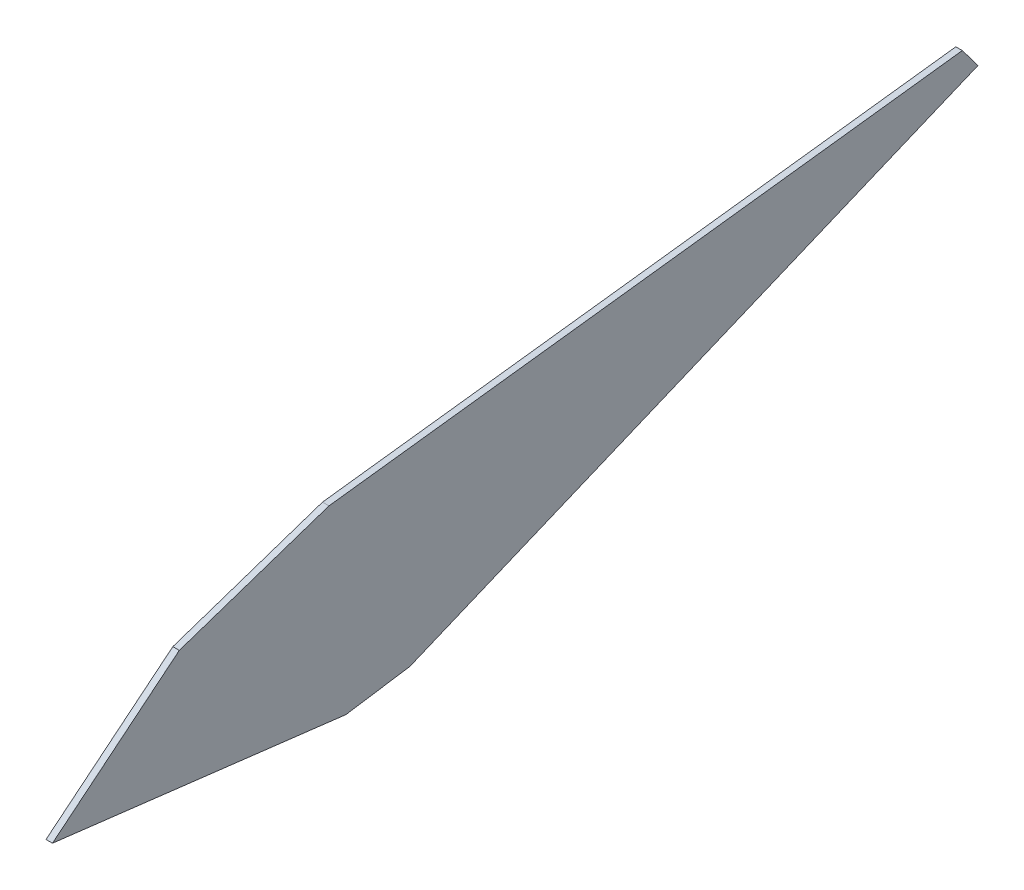
ISO-10303-21;
HEADER;
FILE_DESCRIPTION(('STEP AP214'),'2;1');
FILE_NAME('part.step','',(''),(''),'','','');
FILE_SCHEMA(('AUTOMOTIVE_DESIGN { 1 0 10303 214 1 1 1 1 }'));
ENDSEC;
DATA;
#1=APPLICATION_CONTEXT('core data for automotive mechanical design processes');
#2=APPLICATION_PROTOCOL_DEFINITION('international standard','automotive_design',2000,#1);
#3=PRODUCT_CONTEXT('',#1,'mechanical');
#4=PRODUCT('Part','Part','',(#3));
#5=PRODUCT_RELATED_PRODUCT_CATEGORY('part','',(#4));
#6=PRODUCT_DEFINITION_FORMATION('','',#4);
#7=PRODUCT_DEFINITION_CONTEXT('part definition',#1,'design');
#8=PRODUCT_DEFINITION('design','',#6,#7);
#9=PRODUCT_DEFINITION_SHAPE('','',#8);
#10=(LENGTH_UNIT() NAMED_UNIT(*) SI_UNIT(.MILLI.,.METRE.));
#11=(NAMED_UNIT(*) PLANE_ANGLE_UNIT() SI_UNIT($,.RADIAN.));
#12=(NAMED_UNIT(*) SI_UNIT($,.STERADIAN.) SOLID_ANGLE_UNIT());
#13=UNCERTAINTY_MEASURE_WITH_UNIT(LENGTH_MEASURE(1.E-05),#10,'distance_accuracy_value','');
#14=(GEOMETRIC_REPRESENTATION_CONTEXT(3) GLOBAL_UNCERTAINTY_ASSIGNED_CONTEXT((#13)) GLOBAL_UNIT_ASSIGNED_CONTEXT((#10,
#11,#12)) REPRESENTATION_CONTEXT('',''));
#15=CARTESIAN_POINT('',(0.,0.,0.));
#16=DIRECTION('',(0.,0.,1.));
#17=DIRECTION('',(1.,0.,0.));
#18=AXIS2_PLACEMENT_3D('',#15,#16,#17);
#19=CARTESIAN_POINT('',(0.635,-17.46504,30.30982));
#20=DIRECTION('',(0.,0.923267357697167,0.384158022447652));
#21=DIRECTION('',(0.,-0.384158022447652,0.923267357697168));
#22=AXIS2_PLACEMENT_3D('',#19,#20,#21);
#23=PLANE('',#22);
#24=DIRECTION('',(0.,0.384158022447652,-0.923267357697168));
#25=VECTOR('',#24,1.);
#26=CARTESIAN_POINT('',(0.,-17.46504,30.30982));
#27=LINE('',#26,#25);
#28=CARTESIAN_POINT('',(0.,-17.46504,30.30982));
#29=VERTEX_POINT('',#28);
#30=CARTESIAN_POINT('',(0.,5.715,-25.4));
#31=VERTEX_POINT('',#30);
#32=EDGE_CURVE('E124',#29,#31,#27,.T.);
#33=ORIENTED_EDGE('',*,*,#32,.T.);
#34=DIRECTION('',(-1.,0.,0.));
#35=VECTOR('',#34,1.);
#36=CARTESIAN_POINT('',(0.635,5.715,-25.4));
#37=LINE('',#36,#35);
#38=CARTESIAN_POINT('',(0.635,5.715,-25.4));
#39=VERTEX_POINT('',#38);
#40=EDGE_CURVE('E11',#39,#31,#37,.T.);
#41=ORIENTED_EDGE('',*,*,#40,.F.);
#42=DIRECTION('',(0.,0.384158022447652,-0.923267357697168));
#43=VECTOR('',#42,1.);
#44=CARTESIAN_POINT('',(0.635,-17.46504,30.30982));
#45=LINE('',#44,#43);
#46=CARTESIAN_POINT('',(0.635,-17.46504,30.30982));
#47=VERTEX_POINT('',#46);
#48=EDGE_CURVE('E136',#47,#39,#45,.T.);
#49=ORIENTED_EDGE('',*,*,#48,.F.);
#50=DIRECTION('',(-1.,0.,0.));
#51=VECTOR('',#50,1.);
#52=CARTESIAN_POINT('',(0.635,-17.46504,30.30982));
#53=LINE('',#52,#51);
#54=EDGE_CURVE('E120',#47,#29,#53,.T.);
#55=ORIENTED_EDGE('',*,*,#54,.T.);
#56=EDGE_LOOP('',(#33,#41,#49,#55));
#57=FACE_BOUND('',#56,.T.);
#58=ADVANCED_FACE('F34',(#57),#23,.F.);
#59=CARTESIAN_POINT('',(0.635,5.715,-25.4));
#60=DIRECTION('',(0.,-0.601905322033391,0.798567456955191));
#61=DIRECTION('',(0.,-0.798567456955191,-0.601905322033391));
#62=AXIS2_PLACEMENT_3D('',#59,#60,#61);
#63=PLANE('',#62);
#64=DIRECTION('',(0.,0.798567456955191,0.601905322033391));
#65=VECTOR('',#64,1.);
#66=CARTESIAN_POINT('',(0.,5.715,-25.4));
#67=LINE('',#66,#65);
#68=CARTESIAN_POINT('',(0.,7.75716,-23.86076));
#69=VERTEX_POINT('',#68);
#70=EDGE_CURVE('E127',#31,#69,#67,.T.);
#71=ORIENTED_EDGE('',*,*,#70,.T.);
#72=DIRECTION('',(-1.,0.,0.));
#73=VECTOR('',#72,1.);
#74=CARTESIAN_POINT('',(0.635,7.75716,-23.86076));
#75=LINE('',#74,#73);
#76=CARTESIAN_POINT('',(0.635,7.75716,-23.86076));
#77=VERTEX_POINT('',#76);
#78=EDGE_CURVE('E42',#77,#69,#75,.T.);
#79=ORIENTED_EDGE('',*,*,#78,.F.);
#80=DIRECTION('',(0.,0.798567456955191,0.601905322033391));
#81=VECTOR('',#80,1.);
#82=CARTESIAN_POINT('',(0.635,5.715,-25.4));
#83=LINE('',#82,#81);
#84=EDGE_CURVE('E90',#39,#77,#83,.T.);
#85=ORIENTED_EDGE('',*,*,#84,.F.);
#86=ORIENTED_EDGE('',*,*,#40,.T.);
#87=EDGE_LOOP('',(#71,#79,#85,#86));
#88=FACE_BOUND('',#87,.T.);
#89=ADVANCED_FACE('F161',(#88),#63,.F.);
#90=CARTESIAN_POINT('',(0.635,7.75716,-23.86076));
#91=DIRECTION('',(0.,-0.992563085406152,-0.121731349655791));
#92=DIRECTION('',(0.,0.121731349655791,-0.992563085406152));
#93=AXIS2_PLACEMENT_3D('',#90,#91,#92);
#94=PLANE('',#93);
#95=DIRECTION('',(0.,-0.121731349655791,0.992563085406152));
#96=VECTOR('',#95,1.);
#97=CARTESIAN_POINT('',(0.,7.75716,-23.86076));
#98=LINE('',#97,#96);
#99=CARTESIAN_POINT('',(0.,0.1397,38.24986));
#100=VERTEX_POINT('',#99);
#101=EDGE_CURVE('E129',#69,#100,#98,.T.);
#102=ORIENTED_EDGE('',*,*,#101,.T.);
#103=DIRECTION('',(-1.,0.,0.));
#104=VECTOR('',#103,1.);
#105=CARTESIAN_POINT('',(0.635,0.1397,38.24986));
#106=LINE('',#105,#104);
#107=CARTESIAN_POINT('',(0.635,0.1397,38.24986));
#108=VERTEX_POINT('',#107);
#109=EDGE_CURVE('E140',#108,#100,#106,.T.);
#110=ORIENTED_EDGE('',*,*,#109,.F.);
#111=DIRECTION('',(0.,-0.121731349655791,0.992563085406152));
#112=VECTOR('',#111,1.);
#113=CARTESIAN_POINT('',(0.635,7.75716,-23.86076));
#114=LINE('',#113,#112);
#115=EDGE_CURVE('E148',#77,#108,#114,.T.);
#116=ORIENTED_EDGE('',*,*,#115,.F.);
#117=ORIENTED_EDGE('',*,*,#78,.T.);
#118=EDGE_LOOP('',(#102,#110,#116,#117));
#119=FACE_BOUND('',#118,.T.);
#120=ADVANCED_FACE('F146',(#119),#94,.F.);
#121=CARTESIAN_POINT('',(0.635,0.1397,38.24986));
#122=DIRECTION('',(0.,-0.947876671886927,-0.318637434857491));
#123=DIRECTION('',(0.,0.318637434857491,-0.947876671886927));
#124=AXIS2_PLACEMENT_3D('',#121,#122,#123);
#125=PLANE('',#124);
#126=DIRECTION('',(0.,-0.318637434857491,0.947876671886928));
#127=VECTOR('',#126,1.);
#128=CARTESIAN_POINT('',(0.,0.1397,38.24986));
#129=LINE('',#128,#127);
#130=CARTESIAN_POINT('',(0.,-4.79552,52.93106));
#131=VERTEX_POINT('',#130);
#132=EDGE_CURVE('E131',#100,#131,#129,.T.);
#133=ORIENTED_EDGE('',*,*,#132,.T.);
#134=DIRECTION('',(-1.,0.,0.));
#135=VECTOR('',#134,1.);
#136=CARTESIAN_POINT('',(0.635,-4.79552,52.93106));
#137=LINE('',#136,#135);
#138=CARTESIAN_POINT('',(0.635,-4.79552,52.93106));
#139=VERTEX_POINT('',#138);
#140=EDGE_CURVE('E115',#139,#131,#137,.T.);
#141=ORIENTED_EDGE('',*,*,#140,.F.);
#142=DIRECTION('',(0.,-0.318637434857491,0.947876671886928));
#143=VECTOR('',#142,1.);
#144=CARTESIAN_POINT('',(0.635,0.1397,38.24986));
#145=LINE('',#144,#143);
#146=EDGE_CURVE('E106',#108,#139,#145,.T.);
#147=ORIENTED_EDGE('',*,*,#146,.F.);
#148=ORIENTED_EDGE('',*,*,#109,.T.);
#149=EDGE_LOOP('',(#133,#141,#147,#148));
#150=FACE_BOUND('',#149,.T.);
#151=ADVANCED_FACE('F154',(#150),#125,.F.);
#152=CARTESIAN_POINT('',(0.635,-4.79552,52.93106));
#153=DIRECTION('',(0.,-0.77447143004225,-0.632608887108229));
#154=DIRECTION('',(0.,0.632608887108229,-0.77447143004225));
#155=AXIS2_PLACEMENT_3D('',#152,#153,#154);
#156=PLANE('',#155);
#157=DIRECTION('',(0.,-0.632608887108229,0.77447143004225));
#158=VECTOR('',#157,1.);
#159=CARTESIAN_POINT('',(0.,-4.79552,52.93106));
#160=LINE('',#159,#158);
#161=CARTESIAN_POINT('',(0.,-14.95552,65.36944));
#162=VERTEX_POINT('',#161);
#163=EDGE_CURVE('E114',#131,#162,#160,.T.);
#164=ORIENTED_EDGE('',*,*,#163,.T.);
#165=DIRECTION('',(-1.,0.,0.));
#166=VECTOR('',#165,1.);
#167=CARTESIAN_POINT('',(0.635,-14.95552,65.36944));
#168=LINE('',#167,#166);
#169=CARTESIAN_POINT('',(0.635,-14.95552,65.36944));
#170=VERTEX_POINT('',#169);
#171=EDGE_CURVE('E111',#170,#162,#168,.T.);
#172=ORIENTED_EDGE('',*,*,#171,.F.);
#173=DIRECTION('',(0.,-0.632608887108229,0.77447143004225));
#174=VECTOR('',#173,1.);
#175=CARTESIAN_POINT('',(0.635,-4.79552,52.93106));
#176=LINE('',#175,#174);
#177=EDGE_CURVE('E100',#139,#170,#176,.T.);
#178=ORIENTED_EDGE('',*,*,#177,.F.);
#179=ORIENTED_EDGE('',*,*,#140,.T.);
#180=EDGE_LOOP('',(#164,#172,#178,#179));
#181=FACE_BOUND('',#180,.T.);
#182=ADVANCED_FACE('F112',(#181),#156,.F.);
#183=CARTESIAN_POINT('',(0.635,-14.95552,65.36944));
#184=DIRECTION('',(0.,0.992823258998328,-0.11959087085534));
#185=DIRECTION('',(0.,0.11959087085534,0.992823258998328));
#186=AXIS2_PLACEMENT_3D('',#183,#184,#185);
#187=PLANE('',#186);
#188=DIRECTION('',(0.,-0.11959087085534,-0.992823258998328));
#189=VECTOR('',#188,1.);
#190=CARTESIAN_POINT('',(0.,-14.95552,65.36944));
#191=LINE('',#190,#189);
#192=CARTESIAN_POINT('',(0.,-18.42262,36.58616));
#193=VERTEX_POINT('',#192);
#194=EDGE_CURVE('E76',#162,#193,#191,.T.);
#195=ORIENTED_EDGE('',*,*,#194,.T.);
#196=DIRECTION('',(-1.,0.,0.));
#197=VECTOR('',#196,1.);
#198=CARTESIAN_POINT('',(0.635,-18.42262,36.58616));
#199=LINE('',#198,#197);
#200=CARTESIAN_POINT('',(0.635,-18.42262,36.58616));
#201=VERTEX_POINT('',#200);
#202=EDGE_CURVE('E116',#201,#193,#199,.T.);
#203=ORIENTED_EDGE('',*,*,#202,.F.);
#204=DIRECTION('',(0.,-0.11959087085534,-0.992823258998328));
#205=VECTOR('',#204,1.);
#206=CARTESIAN_POINT('',(0.635,-14.95552,65.36944));
#207=LINE('',#206,#205);
#208=EDGE_CURVE('E104',#170,#201,#207,.T.);
#209=ORIENTED_EDGE('',*,*,#208,.F.);
#210=ORIENTED_EDGE('',*,*,#171,.T.);
#211=EDGE_LOOP('',(#195,#203,#209,#210));
#212=FACE_BOUND('',#211,.T.);
#213=ADVANCED_FACE('F118',(#212),#187,.F.);
#214=CARTESIAN_POINT('',(0.635,-18.42262,36.58616));
#215=DIRECTION('',(0.,0.988560555272323,0.15082449588736));
#216=DIRECTION('',(0.,-0.15082449588736,0.988560555272323));
#217=AXIS2_PLACEMENT_3D('',#214,#215,#216);
#218=PLANE('',#217);
#219=DIRECTION('',(0.,0.15082449588736,-0.988560555272323));
#220=VECTOR('',#219,1.);
#221=CARTESIAN_POINT('',(0.,-18.42262,36.58616));
#222=LINE('',#221,#220);
#223=EDGE_CURVE('E82',#193,#29,#222,.T.);
#224=ORIENTED_EDGE('',*,*,#223,.T.);
#225=ORIENTED_EDGE('',*,*,#54,.F.);
#226=DIRECTION('',(0.,0.15082449588736,-0.988560555272323));
#227=VECTOR('',#226,1.);
#228=CARTESIAN_POINT('',(0.635,-18.42262,36.58616));
#229=LINE('',#228,#227);
#230=EDGE_CURVE('E50',#201,#47,#229,.T.);
#231=ORIENTED_EDGE('',*,*,#230,.F.);
#232=ORIENTED_EDGE('',*,*,#202,.T.);
#233=EDGE_LOOP('',(#224,#225,#231,#232));
#234=FACE_BOUND('',#233,.T.);
#235=ADVANCED_FACE('F175',(#234),#218,.F.);
#236=CARTESIAN_POINT('',(0.635,0.,0.));
#237=DIRECTION('',(1.,0.,0.));
#238=DIRECTION('',(0.,0.,-1.));
#239=AXIS2_PLACEMENT_3D('',#236,#237,#238);
#240=PLANE('',#239);
#241=ORIENTED_EDGE('',*,*,#48,.T.);
#242=ORIENTED_EDGE('',*,*,#84,.T.);
#243=ORIENTED_EDGE('',*,*,#115,.T.);
#244=ORIENTED_EDGE('',*,*,#146,.T.);
#245=ORIENTED_EDGE('',*,*,#177,.T.);
#246=ORIENTED_EDGE('',*,*,#208,.T.);
#247=ORIENTED_EDGE('',*,*,#230,.T.);
#248=EDGE_LOOP('',(#241,#242,#243,#244,#245,#246,#247));
#249=FACE_BOUND('',#248,.T.);
#250=ADVANCED_FACE('F102',(#249),#240,.T.);
#251=CARTESIAN_POINT('',(0.,0.,0.));
#252=DIRECTION('',(1.,0.,0.));
#253=DIRECTION('',(0.,0.,-1.));
#254=AXIS2_PLACEMENT_3D('',#251,#252,#253);
#255=PLANE('',#254);
#256=ORIENTED_EDGE('',*,*,#32,.F.);
#257=ORIENTED_EDGE('',*,*,#223,.F.);
#258=ORIENTED_EDGE('',*,*,#194,.F.);
#259=ORIENTED_EDGE('',*,*,#163,.F.);
#260=ORIENTED_EDGE('',*,*,#132,.F.);
#261=ORIENTED_EDGE('',*,*,#101,.F.);
#262=ORIENTED_EDGE('',*,*,#70,.F.);
#263=EDGE_LOOP('',(#256,#257,#258,#259,#260,#261,#262));
#264=FACE_BOUND('',#263,.T.);
#265=ADVANCED_FACE('F152',(#264),#255,.F.);
#266=CLOSED_SHELL('',(#58,#89,#120,#151,#182,#213,#235,#250,#265));
#267=MANIFOLD_SOLID_BREP('B2',#266);
#268=ADVANCED_BREP_SHAPE_REPRESENTATION('',(#18,#267),#14);
#269=SHAPE_DEFINITION_REPRESENTATION(#9,#268);
ENDSEC;
END-ISO-10303-21;
